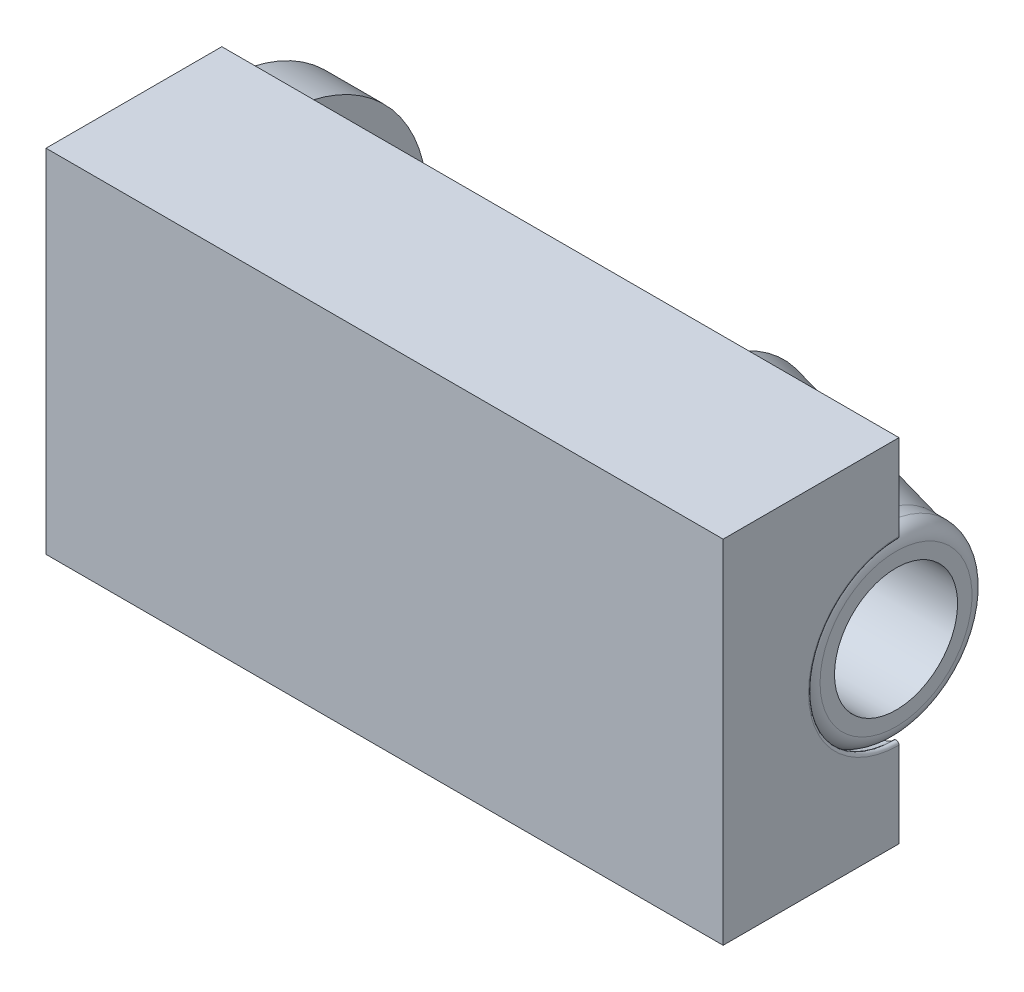
ISO-10303-21;
HEADER;
FILE_DESCRIPTION(('STEP AP214'),'2;1');
FILE_NAME('part.step','',(''),(''),'','','');
FILE_SCHEMA(('AUTOMOTIVE_DESIGN { 1 0 10303 214 1 1 1 1 }'));
ENDSEC;
DATA;
#1=APPLICATION_CONTEXT('core data for automotive mechanical design processes');
#2=APPLICATION_PROTOCOL_DEFINITION('international standard','automotive_design',2000,#1);
#3=PRODUCT_CONTEXT('',#1,'mechanical');
#4=PRODUCT('Part','Part','',(#3));
#5=PRODUCT_RELATED_PRODUCT_CATEGORY('part','',(#4));
#6=PRODUCT_DEFINITION_FORMATION('','',#4);
#7=PRODUCT_DEFINITION_CONTEXT('part definition',#1,'design');
#8=PRODUCT_DEFINITION('design','',#6,#7);
#9=PRODUCT_DEFINITION_SHAPE('','',#8);
#10=(LENGTH_UNIT() NAMED_UNIT(*) SI_UNIT(.MILLI.,.METRE.));
#11=(NAMED_UNIT(*) PLANE_ANGLE_UNIT() SI_UNIT($,.RADIAN.));
#12=(NAMED_UNIT(*) SI_UNIT($,.STERADIAN.) SOLID_ANGLE_UNIT());
#13=UNCERTAINTY_MEASURE_WITH_UNIT(LENGTH_MEASURE(1.E-05),#10,'distance_accuracy_value','');
#14=(GEOMETRIC_REPRESENTATION_CONTEXT(3) GLOBAL_UNCERTAINTY_ASSIGNED_CONTEXT((#13)) GLOBAL_UNIT_ASSIGNED_CONTEXT((#10,
#11,#12)) REPRESENTATION_CONTEXT('',''));
#15=CARTESIAN_POINT('',(0.,0.,0.));
#16=DIRECTION('',(0.,0.,1.));
#17=DIRECTION('',(1.,0.,0.));
#18=AXIS2_PLACEMENT_3D('',#15,#16,#17);
#19=CARTESIAN_POINT('',(21.,2.592,0.));
#20=DIRECTION('',(-1.,0.,0.));
#21=DIRECTION('',(0.,0.,1.));
#22=AXIS2_PLACEMENT_3D('',#19,#20,#21);
#23=PLANE('',#22);
#24=CARTESIAN_POINT('',(21.,0.,0.));
#25=DIRECTION('',(-1.,0.,0.));
#26=DIRECTION('',(0.,0.,1.));
#27=AXIS2_PLACEMENT_3D('',#24,#25,#26);
#28=CIRCLE('',#27,2.592);
#29=CARTESIAN_POINT('',(21.,0.,2.592));
#30=VERTEX_POINT('',#29);
#31=EDGE_CURVE('E56',#30,#30,#28,.T.);
#32=ORIENTED_EDGE('',*,*,#31,.F.);
#33=EDGE_LOOP('',(#32));
#34=FACE_BOUND('',#33,.T.);
#35=CARTESIAN_POINT('',(21.,0.,0.));
#36=DIRECTION('',(-1.,0.,0.));
#37=DIRECTION('',(0.,0.,1.));
#38=AXIS2_PLACEMENT_3D('',#35,#36,#37);
#39=CIRCLE('',#38,2.1);
#40=CARTESIAN_POINT('',(21.,0.,2.1));
#41=VERTEX_POINT('',#40);
#42=EDGE_CURVE('E68',#41,#41,#39,.T.);
#43=ORIENTED_EDGE('',*,*,#42,.T.);
#44=EDGE_LOOP('',(#43));
#45=FACE_BOUND('',#44,.T.);
#46=ADVANCED_FACE('F52',(#34,#45),#23,.F.);
#47=CARTESIAN_POINT('',(20.492,0.,0.));
#48=DIRECTION('',(-1.,0.,0.));
#49=DIRECTION('',(0.,0.,1.));
#50=AXIS2_PLACEMENT_3D('',#47,#48,#49);
#51=TOROIDAL_SURFACE('',#50,2.592,0.508000000000002);
#52=ORIENTED_EDGE('',*,*,#31,.T.);
#53=EDGE_LOOP('',(#52));
#54=FACE_BOUND('',#53,.T.);
#55=CARTESIAN_POINT('',(20.492,0.,0.));
#56=DIRECTION('',(-1.,0.,0.));
#57=DIRECTION('',(0.,0.,1.));
#58=AXIS2_PLACEMENT_3D('',#55,#56,#57);
#59=CIRCLE('',#58,3.1);
#60=CARTESIAN_POINT('',(20.492,0.,3.1));
#61=VERTEX_POINT('',#60);
#62=EDGE_CURVE('E83',#61,#61,#59,.T.);
#63=ORIENTED_EDGE('',*,*,#62,.F.);
#64=EDGE_LOOP('',(#63));
#65=FACE_BOUND('',#64,.T.);
#66=ADVANCED_FACE('F123',(#54,#65),#51,.T.);
#67=CARTESIAN_POINT('',(0.,0.,0.));
#68=DIRECTION('',(-1.,0.,0.));
#69=DIRECTION('',(0.,0.,1.));
#70=AXIS2_PLACEMENT_3D('',#67,#68,#69);
#71=CYLINDRICAL_SURFACE('',#70,3.1);
#72=ORIENTED_EDGE('',*,*,#62,.T.);
#73=EDGE_LOOP('',(#72));
#74=FACE_BOUND('',#73,.T.);
#75=CARTESIAN_POINT('',(20.,0.,0.));
#76=DIRECTION('',(-1.,0.,0.));
#77=DIRECTION('',(0.,0.,1.));
#78=AXIS2_PLACEMENT_3D('',#75,#76,#77);
#79=CIRCLE('',#78,3.1);
#80=CARTESIAN_POINT('',(20.,0.,3.1));
#81=VERTEX_POINT('',#80);
#82=EDGE_CURVE('E81',#81,#81,#79,.T.);
#83=ORIENTED_EDGE('',*,*,#82,.F.);
#84=EDGE_LOOP('',(#83));
#85=FACE_BOUND('',#84,.T.);
#86=ADVANCED_FACE('F119',(#74,#85),#71,.T.);
#87=CARTESIAN_POINT('',(20.,0.,0.));
#88=DIRECTION('',(-1.,0.,0.));
#89=DIRECTION('',(0.,0.,1.));
#90=AXIS2_PLACEMENT_3D('',#87,#88,#89);
#91=CONICAL_SURFACE('',#90,3.1,0.226892802759263);
#92=ORIENTED_EDGE('',*,*,#82,.T.);
#93=EDGE_LOOP('',(#92));
#94=FACE_BOUND('',#93,.T.);
#95=CARTESIAN_POINT('',(14.,0.,0.));
#96=DIRECTION('',(-1.,0.,0.));
#97=DIRECTION('',(0.,0.,1.));
#98=AXIS2_PLACEMENT_3D('',#95,#96,#97);
#99=CIRCLE('',#98,4.48520914675338);
#100=CARTESIAN_POINT('',(14.,0.,4.48520914675338));
#101=VERTEX_POINT('',#100);
#102=EDGE_CURVE('E78',#101,#101,#99,.T.);
#103=ORIENTED_EDGE('',*,*,#102,.F.);
#104=EDGE_LOOP('',(#103));
#105=FACE_BOUND('',#104,.T.);
#106=ADVANCED_FACE('F115',(#94,#105),#91,.T.);
#107=CARTESIAN_POINT('',(14.,3.1,0.));
#108=DIRECTION('',(1.,0.,0.));
#109=DIRECTION('',(0.,0.,-1.));
#110=AXIS2_PLACEMENT_3D('',#107,#108,#109);
#111=PLANE('',#110);
#112=ORIENTED_EDGE('',*,*,#102,.T.);
#113=EDGE_LOOP('',(#112));
#114=FACE_BOUND('',#113,.T.);
#115=CARTESIAN_POINT('',(14.,0.,0.));
#116=DIRECTION('',(-1.,0.,0.));
#117=DIRECTION('',(0.,0.,1.));
#118=AXIS2_PLACEMENT_3D('',#115,#116,#117);
#119=CIRCLE('',#118,3.1);
#120=CARTESIAN_POINT('',(14.,0.,3.1));
#121=VERTEX_POINT('',#120);
#122=EDGE_CURVE('E75',#121,#121,#119,.T.);
#123=ORIENTED_EDGE('',*,*,#122,.F.);
#124=EDGE_LOOP('',(#123));
#125=FACE_BOUND('',#124,.T.);
#126=ADVANCED_FACE('F111',(#114,#125),#111,.F.);
#127=CARTESIAN_POINT('',(0.,0.,0.));
#128=DIRECTION('',(-1.,0.,0.));
#129=DIRECTION('',(0.,0.,1.));
#130=AXIS2_PLACEMENT_3D('',#127,#128,#129);
#131=CYLINDRICAL_SURFACE('',#130,3.1);
#132=ORIENTED_EDGE('',*,*,#122,.T.);
#133=EDGE_LOOP('',(#132));
#134=FACE_BOUND('',#133,.T.);
#135=CARTESIAN_POINT('',(0.,0.,0.));
#136=DIRECTION('',(-1.,0.,0.));
#137=DIRECTION('',(0.,0.,1.));
#138=AXIS2_PLACEMENT_3D('',#135,#136,#137);
#139=CIRCLE('',#138,3.1);
#140=CARTESIAN_POINT('',(0.,0.,3.1));
#141=VERTEX_POINT('',#140);
#142=EDGE_CURVE('E72',#141,#141,#139,.T.);
#143=ORIENTED_EDGE('',*,*,#142,.F.);
#144=EDGE_LOOP('',(#143));
#145=FACE_BOUND('',#144,.T.);
#146=ADVANCED_FACE('F107',(#134,#145),#131,.T.);
#147=CARTESIAN_POINT('',(0.,0.,0.));
#148=DIRECTION('',(-1.,0.,0.));
#149=DIRECTION('',(0.,0.,1.));
#150=AXIS2_PLACEMENT_3D('',#147,#148,#149);
#151=PLANE('',#150);
#152=ORIENTED_EDGE('',*,*,#142,.T.);
#153=EDGE_LOOP('',(#152));
#154=FACE_BOUND('',#153,.T.);
#155=CARTESIAN_POINT('',(0.,0.,0.));
#156=DIRECTION('',(-1.,0.,0.));
#157=DIRECTION('',(0.,0.,1.));
#158=AXIS2_PLACEMENT_3D('',#155,#156,#157);
#159=CIRCLE('',#158,4.99790373054634);
#160=CARTESIAN_POINT('',(0.,0.,4.99790373054634));
#161=VERTEX_POINT('',#160);
#162=EDGE_CURVE('E60',#161,#161,#159,.T.);
#163=ORIENTED_EDGE('',*,*,#162,.F.);
#164=EDGE_LOOP('',(#163));
#165=FACE_BOUND('',#164,.T.);
#166=ADVANCED_FACE('F104',(#154,#165),#151,.F.);
#167=CARTESIAN_POINT('',(-2.,0.,0.));
#168=DIRECTION('',(-1.,0.,0.));
#169=DIRECTION('',(0.,0.,1.));
#170=AXIS2_PLACEMENT_3D('',#167,#168,#169);
#171=PLANE('',#170);
#172=CARTESIAN_POINT('',(-2.,0.,0.));
#173=DIRECTION('',(-1.,0.,0.));
#174=DIRECTION('',(0.,0.,1.));
#175=AXIS2_PLACEMENT_3D('',#172,#173,#174);
#176=CIRCLE('',#175,4.99790373054634);
#177=CARTESIAN_POINT('',(-2.,0.,4.99790373054634));
#178=VERTEX_POINT('',#177);
#179=EDGE_CURVE('E65',#178,#178,#176,.T.);
#180=ORIENTED_EDGE('',*,*,#179,.T.);
#181=EDGE_LOOP('',(#180));
#182=FACE_BOUND('',#181,.T.);
#183=CARTESIAN_POINT('',(-2.,0.,0.));
#184=DIRECTION('',(-1.,0.,0.));
#185=DIRECTION('',(0.,0.,1.));
#186=AXIS2_PLACEMENT_3D('',#183,#184,#185);
#187=CIRCLE('',#186,2.1);
#188=CARTESIAN_POINT('',(-2.,0.,2.1));
#189=VERTEX_POINT('',#188);
#190=EDGE_CURVE('E12',#189,#189,#187,.T.);
#191=ORIENTED_EDGE('',*,*,#190,.F.);
#192=EDGE_LOOP('',(#191));
#193=FACE_BOUND('',#192,.T.);
#194=ADVANCED_FACE('F54',(#182,#193),#171,.T.);
#195=CARTESIAN_POINT('',(-2.,0.,0.));
#196=DIRECTION('',(1.,0.,0.));
#197=DIRECTION('',(0.,0.,-1.));
#198=AXIS2_PLACEMENT_3D('',#195,#196,#197);
#199=CYLINDRICAL_SURFACE('',#198,4.99790373054634);
#200=ORIENTED_EDGE('',*,*,#162,.T.);
#201=EDGE_LOOP('',(#200));
#202=FACE_BOUND('',#201,.T.);
#203=ORIENTED_EDGE('',*,*,#179,.F.);
#204=EDGE_LOOP('',(#203));
#205=FACE_BOUND('',#204,.T.);
#206=ADVANCED_FACE('F96',(#202,#205),#199,.T.);
#207=CARTESIAN_POINT('',(0.,0.,0.));
#208=DIRECTION('',(-1.,0.,0.));
#209=DIRECTION('',(0.,0.,1.));
#210=AXIS2_PLACEMENT_3D('',#207,#208,#209);
#211=CYLINDRICAL_SURFACE('',#210,2.1);
#212=ORIENTED_EDGE('',*,*,#190,.T.);
#213=EDGE_LOOP('',(#212));
#214=FACE_BOUND('',#213,.T.);
#215=ORIENTED_EDGE('',*,*,#42,.F.);
#216=EDGE_LOOP('',(#215));
#217=FACE_BOUND('',#216,.T.);
#218=ADVANCED_FACE('F94',(#214,#217),#211,.F.);
#219=CLOSED_SHELL('',(#46,#66,#86,#106,#126,#146,#166,#194,#206,#218));
#220=MANIFOLD_SOLID_BREP('B2',#219);
#221=CARTESIAN_POINT('',(-2.,0.,0.));
#222=DIRECTION('',(1.,0.,0.));
#223=DIRECTION('',(0.,0.,-1.));
#224=AXIS2_PLACEMENT_3D('',#221,#222,#223);
#225=CYLINDRICAL_SURFACE('',#224,5.09790373054634);
#226=DIRECTION('',(1.,0.,0.));
#227=VECTOR('',#226,1.);
#228=CARTESIAN_POINT('',(-2.,5.09790373054634,0.));
#229=LINE('',#228,#227);
#230=CARTESIAN_POINT('',(-2.,5.09790373054634,0.));
#231=VERTEX_POINT('',#230);
#232=CARTESIAN_POINT('',(0.1,5.09790373054634,0.));
#233=VERTEX_POINT('',#232);
#234=EDGE_CURVE('E452',#231,#233,#229,.T.);
#235=ORIENTED_EDGE('',*,*,#234,.T.);
#236=CARTESIAN_POINT('',(0.0999999999999998,0.,0.));
#237=DIRECTION('',(-1.,0.,0.));
#238=DIRECTION('',(0.,0.,1.));
#239=AXIS2_PLACEMENT_3D('',#236,#237,#238);
#240=CIRCLE('',#239,5.09790373054634);
#241=CARTESIAN_POINT('',(0.1,-5.09790373054634,0.));
#242=VERTEX_POINT('',#241);
#243=EDGE_CURVE('E422',#242,#233,#240,.T.);
#244=ORIENTED_EDGE('',*,*,#243,.F.);
#245=DIRECTION('',(1.,0.,0.));
#246=VECTOR('',#245,1.);
#247=CARTESIAN_POINT('',(0.1,-5.09790373054634,0.));
#248=LINE('',#247,#246);
#249=CARTESIAN_POINT('',(-2.,-5.09790373054634,0.));
#250=VERTEX_POINT('',#249);
#251=EDGE_CURVE('E405',#242,#250,#248,.F.);
#252=ORIENTED_EDGE('',*,*,#251,.T.);
#253=CARTESIAN_POINT('',(-2.,0.,0.));
#254=DIRECTION('',(-1.,0.,0.));
#255=DIRECTION('',(0.,0.,1.));
#256=AXIS2_PLACEMENT_3D('',#253,#254,#255);
#257=CIRCLE('',#256,5.09790373054634);
#258=EDGE_CURVE('E421',#250,#231,#257,.T.);
#259=ORIENTED_EDGE('',*,*,#258,.T.);
#260=EDGE_LOOP('',(#235,#244,#252,#259));
#261=FACE_BOUND('',#260,.T.);
#262=ADVANCED_FACE('F244',(#261),#225,.F.);
#263=CARTESIAN_POINT('',(0.1,0.,0.));
#264=DIRECTION('',(-1.,0.,0.));
#265=DIRECTION('',(0.,0.,1.));
#266=AXIS2_PLACEMENT_3D('',#263,#264,#265);
#267=PLANE('',#266);
#268=DIRECTION('',(0.,-1.,0.));
#269=VECTOR('',#268,1.);
#270=CARTESIAN_POINT('',(0.1,0.,0.));
#271=LINE('',#270,#269);
#272=CARTESIAN_POINT('',(0.1,3.2,0.));
#273=VERTEX_POINT('',#272);
#274=EDGE_CURVE('E448',#233,#273,#271,.T.);
#275=ORIENTED_EDGE('',*,*,#274,.T.);
#276=CARTESIAN_POINT('',(0.1,0.,0.));
#277=DIRECTION('',(-1.,0.,0.));
#278=DIRECTION('',(0.,0.,1.));
#279=AXIS2_PLACEMENT_3D('',#276,#277,#278);
#280=CIRCLE('',#279,3.2);
#281=CARTESIAN_POINT('',(0.1,-3.2,0.));
#282=VERTEX_POINT('',#281);
#283=EDGE_CURVE('E417',#282,#273,#280,.T.);
#284=ORIENTED_EDGE('',*,*,#283,.F.);
#285=DIRECTION('',(0.,-1.,0.));
#286=VECTOR('',#285,1.);
#287=CARTESIAN_POINT('',(0.1,0.,0.));
#288=LINE('',#287,#286);
#289=EDGE_CURVE('E451',#282,#242,#288,.T.);
#290=ORIENTED_EDGE('',*,*,#289,.T.);
#291=ORIENTED_EDGE('',*,*,#243,.T.);
#292=EDGE_LOOP('',(#275,#284,#290,#291));
#293=FACE_BOUND('',#292,.T.);
#294=ADVANCED_FACE('F502',(#293),#267,.T.);
#295=CARTESIAN_POINT('',(0.,0.,0.));
#296=DIRECTION('',(-1.,0.,0.));
#297=DIRECTION('',(0.,0.,1.));
#298=AXIS2_PLACEMENT_3D('',#295,#296,#297);
#299=CYLINDRICAL_SURFACE('',#298,3.2);
#300=DIRECTION('',(-1.,0.,0.));
#301=VECTOR('',#300,1.);
#302=CARTESIAN_POINT('',(13.9,-3.2,0.));
#303=LINE('',#302,#301);
#304=CARTESIAN_POINT('',(13.9,-3.2,0.));
#305=VERTEX_POINT('',#304);
#306=EDGE_CURVE('E444',#305,#282,#303,.T.);
#307=ORIENTED_EDGE('',*,*,#306,.T.);
#308=ORIENTED_EDGE('',*,*,#283,.T.);
#309=DIRECTION('',(-1.,0.,0.));
#310=VECTOR('',#309,1.);
#311=CARTESIAN_POINT('',(0.1,3.2,0.));
#312=LINE('',#311,#310);
#313=CARTESIAN_POINT('',(13.9,3.2,0.));
#314=VERTEX_POINT('',#313);
#315=EDGE_CURVE('E445',#273,#314,#312,.F.);
#316=ORIENTED_EDGE('',*,*,#315,.T.);
#317=CARTESIAN_POINT('',(13.9,0.,0.));
#318=DIRECTION('',(1.,0.,0.));
#319=DIRECTION('',(0.,0.,-1.));
#320=AXIS2_PLACEMENT_3D('',#317,#318,#319);
#321=CIRCLE('',#320,3.2);
#322=EDGE_CURVE('E413',#305,#314,#321,.F.);
#323=ORIENTED_EDGE('',*,*,#322,.F.);
#324=EDGE_LOOP('',(#307,#308,#316,#323));
#325=FACE_BOUND('',#324,.T.);
#326=ADVANCED_FACE('F508',(#325),#299,.F.);
#327=CARTESIAN_POINT('',(13.9,3.1,0.));
#328=DIRECTION('',(1.,0.,0.));
#329=DIRECTION('',(0.,0.,-1.));
#330=AXIS2_PLACEMENT_3D('',#327,#328,#329);
#331=PLANE('',#330);
#332=DIRECTION('',(0.,1.,0.));
#333=VECTOR('',#332,1.);
#334=CARTESIAN_POINT('',(13.9,3.1,0.));
#335=LINE('',#334,#333);
#336=CARTESIAN_POINT('',(13.9,-4.61092637664528,0.));
#337=VERTEX_POINT('',#336);
#338=EDGE_CURVE('E440',#337,#305,#335,.T.);
#339=ORIENTED_EDGE('',*,*,#338,.T.);
#340=ORIENTED_EDGE('',*,*,#322,.T.);
#341=DIRECTION('',(0.,1.,0.));
#342=VECTOR('',#341,1.);
#343=CARTESIAN_POINT('',(13.9,3.1,0.));
#344=LINE('',#343,#342);
#345=CARTESIAN_POINT('',(13.9,4.61092637664528,0.));
#346=VERTEX_POINT('',#345);
#347=EDGE_CURVE('E441',#314,#346,#344,.T.);
#348=ORIENTED_EDGE('',*,*,#347,.T.);
#349=CARTESIAN_POINT('',(13.9,0.,0.));
#350=DIRECTION('',(1.,0.,0.));
#351=DIRECTION('',(0.,0.,-1.));
#352=AXIS2_PLACEMENT_3D('',#349,#350,#351);
#353=CIRCLE('',#352,4.61092637664528);
#354=EDGE_CURVE('E409',#337,#346,#353,.F.);
#355=ORIENTED_EDGE('',*,*,#354,.F.);
#356=EDGE_LOOP('',(#339,#340,#348,#355));
#357=FACE_BOUND('',#356,.T.);
#358=ADVANCED_FACE('F514',(#357),#331,.T.);
#359=CARTESIAN_POINT('',(20.0224951054344,0.,0.));
#360=DIRECTION('',(-1.,0.,0.));
#361=DIRECTION('',(0.,0.,1.));
#362=AXIS2_PLACEMENT_3D('',#359,#360,#361);
#363=CONICAL_SURFACE('',#362,3.19743700647852,0.226892802759263);
#364=DIRECTION('',(-0.974370064785235,-0.224951054343865,0.));
#365=VECTOR('',#364,1.);
#366=CARTESIAN_POINT('',(33.8721163585394,0.,0.));
#367=LINE('',#366,#365);
#368=CARTESIAN_POINT('',(20.0113935608302,-3.2,0.));
#369=VERTEX_POINT('',#368);
#370=EDGE_CURVE('E436',#369,#337,#367,.T.);
#371=ORIENTED_EDGE('',*,*,#370,.T.);
#372=ORIENTED_EDGE('',*,*,#354,.T.);
#373=DIRECTION('',(0.974370064785235,-0.224951054343865,0.));
#374=VECTOR('',#373,1.);
#375=CARTESIAN_POINT('',(33.8721163585394,0.,0.));
#376=LINE('',#375,#374);
#377=CARTESIAN_POINT('',(20.0113935608302,3.2,0.));
#378=VERTEX_POINT('',#377);
#379=EDGE_CURVE('E437',#346,#378,#376,.T.);
#380=ORIENTED_EDGE('',*,*,#379,.T.);
#381=CARTESIAN_POINT('',(20.0113935608302,0.,0.));
#382=DIRECTION('',(-1.,0.,0.));
#383=DIRECTION('',(0.,0.,1.));
#384=AXIS2_PLACEMENT_3D('',#381,#382,#383);
#385=CIRCLE('',#384,3.2);
#386=EDGE_CURVE('E404',#369,#378,#385,.T.);
#387=ORIENTED_EDGE('',*,*,#386,.F.);
#388=EDGE_LOOP('',(#371,#372,#380,#387));
#389=FACE_BOUND('',#388,.T.);
#390=ADVANCED_FACE('F518',(#389),#363,.F.);
#391=CARTESIAN_POINT('',(0.,0.,0.));
#392=DIRECTION('',(-1.,0.,0.));
#393=DIRECTION('',(0.,0.,1.));
#394=AXIS2_PLACEMENT_3D('',#391,#392,#393);
#395=CYLINDRICAL_SURFACE('',#394,3.2);
#396=DIRECTION('',(-1.,0.,0.));
#397=VECTOR('',#396,1.);
#398=CARTESIAN_POINT('',(20.492,-3.2,0.));
#399=LINE('',#398,#397);
#400=CARTESIAN_POINT('',(20.492,-3.2,0.));
#401=VERTEX_POINT('',#400);
#402=EDGE_CURVE('E432',#401,#369,#399,.T.);
#403=ORIENTED_EDGE('',*,*,#402,.T.);
#404=ORIENTED_EDGE('',*,*,#386,.T.);
#405=DIRECTION('',(-1.,0.,0.));
#406=VECTOR('',#405,1.);
#407=CARTESIAN_POINT('',(20.0113935608302,3.2,0.));
#408=LINE('',#407,#406);
#409=CARTESIAN_POINT('',(20.492,3.2,0.));
#410=VERTEX_POINT('',#409);
#411=EDGE_CURVE('E433',#378,#410,#408,.F.);
#412=ORIENTED_EDGE('',*,*,#411,.T.);
#413=CARTESIAN_POINT('',(20.492,0.,0.));
#414=DIRECTION('',(-1.,0.,0.));
#415=DIRECTION('',(0.,0.,1.));
#416=AXIS2_PLACEMENT_3D('',#413,#414,#415);
#417=CIRCLE('',#416,3.2);
#418=EDGE_CURVE('E400',#401,#410,#417,.T.);
#419=ORIENTED_EDGE('',*,*,#418,.F.);
#420=EDGE_LOOP('',(#403,#404,#412,#419));
#421=FACE_BOUND('',#420,.T.);
#422=ADVANCED_FACE('F522',(#421),#395,.F.);
#423=CARTESIAN_POINT('',(20.492,0.,0.));
#424=DIRECTION('',(-1.,0.,0.));
#425=DIRECTION('',(0.,0.,1.));
#426=AXIS2_PLACEMENT_3D('',#423,#424,#425);
#427=TOROIDAL_SURFACE('',#426,2.592,0.608000000000002);
#428=CARTESIAN_POINT('',(20.492,2.592,0.));
#429=DIRECTION('',(0.,0.,-1.));
#430=DIRECTION('',(-1.,0.,0.));
#431=AXIS2_PLACEMENT_3D('',#428,#429,#430);
#432=CIRCLE('',#431,0.608000000000002);
#433=CARTESIAN_POINT('',(20.9282485875706,3.01549872472375,0.));
#434=VERTEX_POINT('',#433);
#435=EDGE_CURVE('E429',#410,#434,#432,.T.);
#436=ORIENTED_EDGE('',*,*,#435,.T.);
#437=CARTESIAN_POINT('',(20.9282485875706,0.,0.));
#438=DIRECTION('',(-1.,0.,0.));
#439=DIRECTION('',(0.,0.,1.));
#440=AXIS2_PLACEMENT_3D('',#437,#438,#439);
#441=CIRCLE('',#440,3.01549872472375);
#442=CARTESIAN_POINT('',(20.9282485875706,-3.01549872472375,0.));
#443=VERTEX_POINT('',#442);
#444=EDGE_CURVE('E253',#434,#443,#441,.F.);
#445=ORIENTED_EDGE('',*,*,#444,.T.);
#446=CARTESIAN_POINT('',(20.492,-2.592,0.));
#447=DIRECTION('',(0.,0.,-1.));
#448=DIRECTION('',(-1.,0.,0.));
#449=AXIS2_PLACEMENT_3D('',#446,#447,#448);
#450=CIRCLE('',#449,0.608000000000002);
#451=EDGE_CURVE('E396',#443,#401,#450,.T.);
#452=ORIENTED_EDGE('',*,*,#451,.T.);
#453=ORIENTED_EDGE('',*,*,#418,.T.);
#454=EDGE_LOOP('',(#436,#445,#452,#453));
#455=FACE_BOUND('',#454,.T.);
#456=ADVANCED_FACE('F526',(#455),#427,.F.);
#457=CARTESIAN_POINT('',(-2.,-6.,5.99790373054634));
#458=DIRECTION('',(0.,0.,1.));
#459=DIRECTION('',(1.,0.,0.));
#460=AXIS2_PLACEMENT_3D('',#457,#458,#459);
#461=PLANE('',#460);
#462=DIRECTION('',(1.,0.,0.));
#463=VECTOR('',#462,1.);
#464=CARTESIAN_POINT('',(-2.,-6.,5.99790373054634));
#465=LINE('',#464,#463);
#466=CARTESIAN_POINT('',(-2.,-6.,5.99790373054634));
#467=VERTEX_POINT('',#466);
#468=CARTESIAN_POINT('',(21.1,-6.,5.99790373054634));
#469=VERTEX_POINT('',#468);
#470=EDGE_CURVE('E339',#467,#469,#465,.T.);
#471=ORIENTED_EDGE('',*,*,#470,.T.);
#472=DIRECTION('',(0.,-1.,0.));
#473=VECTOR('',#472,1.);
#474=CARTESIAN_POINT('',(21.1,6.,5.99790373054634));
#475=LINE('',#474,#473);
#476=CARTESIAN_POINT('',(21.1,6.,5.99790373054634));
#477=VERTEX_POINT('',#476);
#478=EDGE_CURVE('E344',#477,#469,#475,.T.);
#479=ORIENTED_EDGE('',*,*,#478,.F.);
#480=DIRECTION('',(1.,0.,0.));
#481=VECTOR('',#480,1.);
#482=CARTESIAN_POINT('',(-2.,6.,5.99790373054634));
#483=LINE('',#482,#481);
#484=CARTESIAN_POINT('',(-2.,6.,5.99790373054634));
#485=VERTEX_POINT('',#484);
#486=EDGE_CURVE('E381',#485,#477,#483,.T.);
#487=ORIENTED_EDGE('',*,*,#486,.F.);
#488=DIRECTION('',(0.,1.,0.));
#489=VECTOR('',#488,1.);
#490=CARTESIAN_POINT('',(-2.,-6.,5.99790373054634));
#491=LINE('',#490,#489);
#492=EDGE_CURVE('E345',#467,#485,#491,.T.);
#493=ORIENTED_EDGE('',*,*,#492,.F.);
#494=EDGE_LOOP('',(#471,#479,#487,#493));
#495=FACE_BOUND('',#494,.T.);
#496=ADVANCED_FACE('F341',(#495),#461,.T.);
#497=CARTESIAN_POINT('',(0.,6.,0.));
#498=DIRECTION('',(0.,1.,0.));
#499=DIRECTION('',(0.,0.,1.));
#500=AXIS2_PLACEMENT_3D('',#497,#498,#499);
#501=PLANE('',#500);
#502=DIRECTION('',(0.,0.,1.));
#503=VECTOR('',#502,1.);
#504=CARTESIAN_POINT('',(-2.,6.,0.));
#505=LINE('',#504,#503);
#506=CARTESIAN_POINT('',(-2.,6.,0.));
#507=VERTEX_POINT('',#506);
#508=EDGE_CURVE('E377',#507,#485,#505,.T.);
#509=ORIENTED_EDGE('',*,*,#508,.T.);
#510=ORIENTED_EDGE('',*,*,#486,.T.);
#511=DIRECTION('',(0.,0.,1.));
#512=VECTOR('',#511,1.);
#513=CARTESIAN_POINT('',(21.1,6.,5.99790373054634));
#514=LINE('',#513,#512);
#515=CARTESIAN_POINT('',(21.1,6.,0.));
#516=VERTEX_POINT('',#515);
#517=EDGE_CURVE('E366',#516,#477,#514,.T.);
#518=ORIENTED_EDGE('',*,*,#517,.F.);
#519=DIRECTION('',(-1.,0.,0.));
#520=VECTOR('',#519,1.);
#521=CARTESIAN_POINT('',(-2.,6.,0.));
#522=LINE('',#521,#520);
#523=EDGE_CURVE('E384',#516,#507,#522,.T.);
#524=ORIENTED_EDGE('',*,*,#523,.T.);
#525=EDGE_LOOP('',(#509,#510,#518,#524));
#526=FACE_BOUND('',#525,.T.);
#527=ADVANCED_FACE('F489',(#526),#501,.T.);
#528=CARTESIAN_POINT('',(-2.,-6.,0.));
#529=DIRECTION('',(-1.,0.,0.));
#530=DIRECTION('',(0.,0.,1.));
#531=AXIS2_PLACEMENT_3D('',#528,#529,#530);
#532=PLANE('',#531);
#533=ORIENTED_EDGE('',*,*,#258,.F.);
#534=DIRECTION('',(0.,1.,0.));
#535=VECTOR('',#534,1.);
#536=CARTESIAN_POINT('',(-2.,-6.,0.));
#537=LINE('',#536,#535);
#538=CARTESIAN_POINT('',(-2.,-6.,0.));
#539=VERTEX_POINT('',#538);
#540=EDGE_CURVE('E392',#539,#250,#537,.T.);
#541=ORIENTED_EDGE('',*,*,#540,.F.);
#542=DIRECTION('',(0.,0.,1.));
#543=VECTOR('',#542,1.);
#544=CARTESIAN_POINT('',(-2.,-6.,0.));
#545=LINE('',#544,#543);
#546=EDGE_CURVE('E351',#539,#467,#545,.T.);
#547=ORIENTED_EDGE('',*,*,#546,.T.);
#548=ORIENTED_EDGE('',*,*,#492,.T.);
#549=ORIENTED_EDGE('',*,*,#508,.F.);
#550=EDGE_CURVE('E397',#231,#507,#537,.T.);
#551=ORIENTED_EDGE('',*,*,#550,.F.);
#552=EDGE_LOOP('',(#533,#541,#547,#548,#549,#551));
#553=FACE_BOUND('',#552,.T.);
#554=ADVANCED_FACE('F490',(#553),#532,.T.);
#555=CARTESIAN_POINT('',(0.,-6.,0.));
#556=DIRECTION('',(0.,1.,0.));
#557=DIRECTION('',(0.,0.,1.));
#558=AXIS2_PLACEMENT_3D('',#555,#556,#557);
#559=PLANE('',#558);
#560=ORIENTED_EDGE('',*,*,#546,.F.);
#561=DIRECTION('',(-1.,0.,0.));
#562=VECTOR('',#561,1.);
#563=CARTESIAN_POINT('',(-2.,-6.,0.));
#564=LINE('',#563,#562);
#565=CARTESIAN_POINT('',(21.1,-6.,0.));
#566=VERTEX_POINT('',#565);
#567=EDGE_CURVE('E350',#566,#539,#564,.T.);
#568=ORIENTED_EDGE('',*,*,#567,.F.);
#569=DIRECTION('',(0.,0.,-1.));
#570=VECTOR('',#569,1.);
#571=CARTESIAN_POINT('',(21.1,-6.,5.99790373054634));
#572=LINE('',#571,#570);
#573=EDGE_CURVE('E354',#469,#566,#572,.T.);
#574=ORIENTED_EDGE('',*,*,#573,.F.);
#575=ORIENTED_EDGE('',*,*,#470,.F.);
#576=EDGE_LOOP('',(#560,#568,#574,#575));
#577=FACE_BOUND('',#576,.T.);
#578=ADVANCED_FACE('F355',(#577),#559,.F.);
#579=CARTESIAN_POINT('',(-2.,-6.,0.));
#580=DIRECTION('',(0.,0.,-1.));
#581=DIRECTION('',(-1.,0.,0.));
#582=AXIS2_PLACEMENT_3D('',#579,#580,#581);
#583=PLANE('',#582);
#584=ORIENTED_EDGE('',*,*,#451,.F.);
#585=CARTESIAN_POINT('',(21.,-3.08515312023752,0.));
#586=DIRECTION('',(0.,0.,-1.));
#587=DIRECTION('',(-1.,0.,0.));
#588=AXIS2_PLACEMENT_3D('',#585,#586,#587);
#589=CIRCLE('',#588,0.1);
#590=CARTESIAN_POINT('',(21.1,-3.08515312023752,0.));
#591=VERTEX_POINT('',#590);
#592=EDGE_CURVE('E50',#443,#591,#589,.T.);
#593=ORIENTED_EDGE('',*,*,#592,.T.);
#594=DIRECTION('',(0.,1.,0.));
#595=VECTOR('',#594,1.);
#596=CARTESIAN_POINT('',(21.1,-2.592,0.));
#597=LINE('',#596,#595);
#598=EDGE_CURVE('E361',#566,#591,#597,.T.);
#599=ORIENTED_EDGE('',*,*,#598,.F.);
#600=ORIENTED_EDGE('',*,*,#567,.T.);
#601=ORIENTED_EDGE('',*,*,#540,.T.);
#602=ORIENTED_EDGE('',*,*,#251,.F.);
#603=ORIENTED_EDGE('',*,*,#289,.F.);
#604=ORIENTED_EDGE('',*,*,#306,.F.);
#605=ORIENTED_EDGE('',*,*,#338,.F.);
#606=ORIENTED_EDGE('',*,*,#370,.F.);
#607=ORIENTED_EDGE('',*,*,#402,.F.);
#608=EDGE_LOOP('',(#584,#593,#599,#600,#601,#602,#603,#604,#605,#606,#607));
#609=FACE_BOUND('',#608,.T.);
#610=ADVANCED_FACE('F492',(#609),#583,.T.);
#611=DIRECTION('',(0.,1.,0.));
#612=VECTOR('',#611,1.);
#613=CARTESIAN_POINT('',(21.1,6.,0.));
#614=LINE('',#613,#612);
#615=CARTESIAN_POINT('',(21.1,3.08515312023752,0.));
#616=VERTEX_POINT('',#615);
#617=EDGE_CURVE('E372',#616,#516,#614,.T.);
#618=ORIENTED_EDGE('',*,*,#617,.F.);
#619=CARTESIAN_POINT('',(21.,3.08515312023752,0.));
#620=DIRECTION('',(0.,0.,-1.));
#621=DIRECTION('',(-1.,0.,0.));
#622=AXIS2_PLACEMENT_3D('',#619,#620,#621);
#623=CIRCLE('',#622,0.1);
#624=EDGE_CURVE('E267',#616,#434,#623,.T.);
#625=ORIENTED_EDGE('',*,*,#624,.T.);
#626=ORIENTED_EDGE('',*,*,#435,.F.);
#627=ORIENTED_EDGE('',*,*,#411,.F.);
#628=ORIENTED_EDGE('',*,*,#379,.F.);
#629=ORIENTED_EDGE('',*,*,#347,.F.);
#630=ORIENTED_EDGE('',*,*,#315,.F.);
#631=ORIENTED_EDGE('',*,*,#274,.F.);
#632=ORIENTED_EDGE('',*,*,#234,.F.);
#633=ORIENTED_EDGE('',*,*,#550,.T.);
#634=ORIENTED_EDGE('',*,*,#523,.F.);
#635=EDGE_LOOP('',(#618,#625,#626,#627,#628,#629,#630,#631,#632,#633,#634));
#636=FACE_BOUND('',#635,.T.);
#637=ADVANCED_FACE('F484',(#636),#583,.T.);
#638=CARTESIAN_POINT('',(21.1,0.,0.));
#639=DIRECTION('',(1.,0.,0.));
#640=DIRECTION('',(0.,0.,-1.));
#641=AXIS2_PLACEMENT_3D('',#638,#639,#640);
#642=PLANE('',#641);
#643=ORIENTED_EDGE('',*,*,#598,.T.);
#644=CARTESIAN_POINT('',(21.1,0.,0.));
#645=DIRECTION('',(1.,0.,0.));
#646=DIRECTION('',(0.,0.,-1.));
#647=AXIS2_PLACEMENT_3D('',#644,#645,#646);
#648=CIRCLE('',#647,3.08515312023752);
#649=EDGE_CURVE('E426',#591,#616,#648,.F.);
#650=ORIENTED_EDGE('',*,*,#649,.T.);
#651=ORIENTED_EDGE('',*,*,#617,.T.);
#652=ORIENTED_EDGE('',*,*,#517,.T.);
#653=ORIENTED_EDGE('',*,*,#478,.T.);
#654=ORIENTED_EDGE('',*,*,#573,.T.);
#655=EDGE_LOOP('',(#643,#650,#651,#652,#653,#654));
#656=FACE_BOUND('',#655,.T.);
#657=ADVANCED_FACE('F364',(#656),#642,.T.);
#658=CARTESIAN_POINT('',(21.,0.,0.));
#659=DIRECTION('',(1.,0.,0.));
#660=DIRECTION('',(0.,0.,-1.));
#661=AXIS2_PLACEMENT_3D('',#658,#659,#660);
#662=TOROIDAL_SURFACE('',#661,3.08515312023752,0.1);
#663=ORIENTED_EDGE('',*,*,#592,.F.);
#664=ORIENTED_EDGE('',*,*,#444,.F.);
#665=ORIENTED_EDGE('',*,*,#624,.F.);
#666=ORIENTED_EDGE('',*,*,#649,.F.);
#667=EDGE_LOOP('',(#663,#664,#665,#666));
#668=FACE_BOUND('',#667,.T.);
#669=ADVANCED_FACE('F246',(#668),#662,.T.);
#670=CLOSED_SHELL('',(#262,#294,#326,#358,#390,#422,#456,#496,#527,#554,#578,#610,#637,#657,#669));
#671=MANIFOLD_SOLID_BREP('B7',#670);
#672=ADVANCED_BREP_SHAPE_REPRESENTATION('',(#18,#220,#671),#14);
#673=SHAPE_DEFINITION_REPRESENTATION(#9,#672);
ENDSEC;
END-ISO-10303-21;
